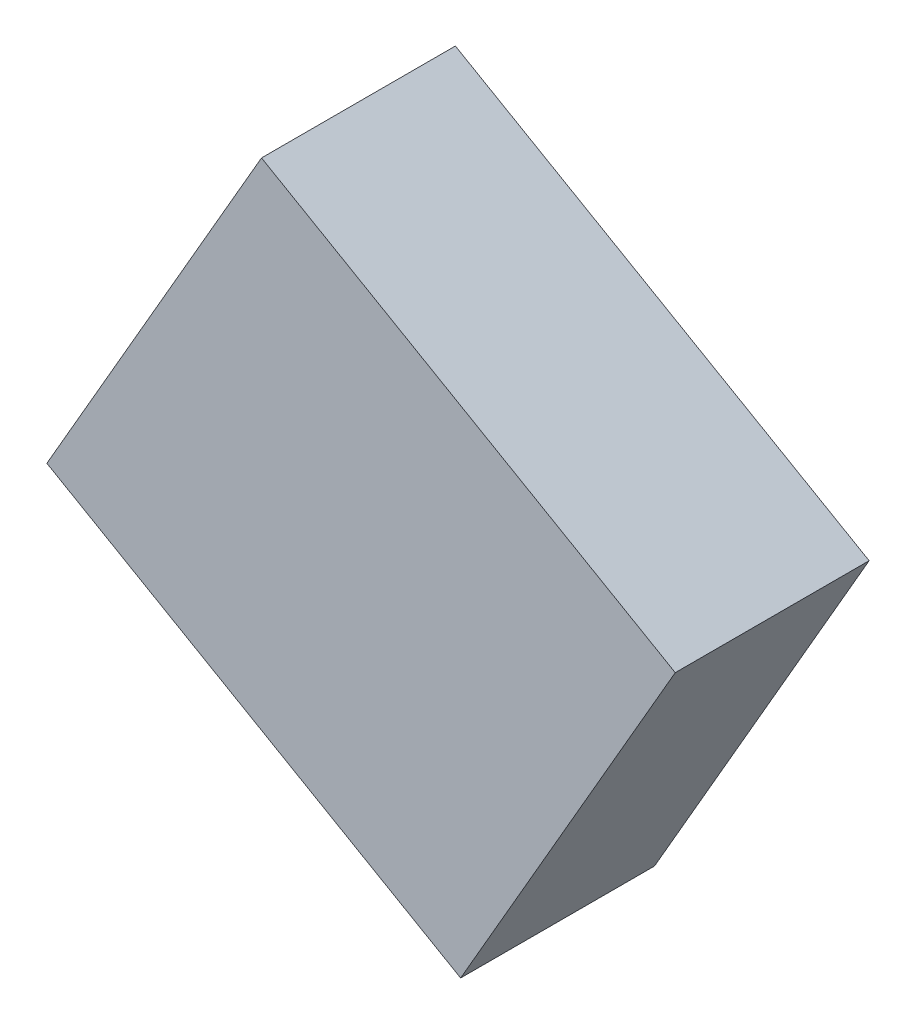
ISO-10303-21;
HEADER;
FILE_DESCRIPTION(('STEP AP214'),'2;1');
FILE_NAME('part.step','',(''),(''),'','','');
FILE_SCHEMA(('AUTOMOTIVE_DESIGN { 1 0 10303 214 1 1 1 1 }'));
ENDSEC;
DATA;
#1=APPLICATION_CONTEXT('core data for automotive mechanical design processes');
#2=APPLICATION_PROTOCOL_DEFINITION('international standard','automotive_design',2000,#1);
#3=PRODUCT_CONTEXT('',#1,'mechanical');
#4=PRODUCT('Part','Part','',(#3));
#5=PRODUCT_RELATED_PRODUCT_CATEGORY('part','',(#4));
#6=PRODUCT_DEFINITION_FORMATION('','',#4);
#7=PRODUCT_DEFINITION_CONTEXT('part definition',#1,'design');
#8=PRODUCT_DEFINITION('design','',#6,#7);
#9=PRODUCT_DEFINITION_SHAPE('','',#8);
#10=(LENGTH_UNIT() NAMED_UNIT(*) SI_UNIT(.MILLI.,.METRE.));
#11=(NAMED_UNIT(*) PLANE_ANGLE_UNIT() SI_UNIT($,.RADIAN.));
#12=(NAMED_UNIT(*) SI_UNIT($,.STERADIAN.) SOLID_ANGLE_UNIT());
#13=UNCERTAINTY_MEASURE_WITH_UNIT(LENGTH_MEASURE(1.E-05),#10,'distance_accuracy_value','');
#14=(GEOMETRIC_REPRESENTATION_CONTEXT(3) GLOBAL_UNCERTAINTY_ASSIGNED_CONTEXT((#13)) GLOBAL_UNIT_ASSIGNED_CONTEXT((#10,
#11,#12)) REPRESENTATION_CONTEXT('',''));
#15=CARTESIAN_POINT('',(0.,0.,0.));
#16=DIRECTION('',(0.,0.,1.));
#17=DIRECTION('',(1.,0.,0.));
#18=AXIS2_PLACEMENT_3D('',#15,#16,#17);
#19=CARTESIAN_POINT('',(-0.71889366,2.20483938,1.39999974));
#20=DIRECTION('',(0.,0.,-1.));
#21=DIRECTION('',(-1.,0.,0.));
#22=AXIS2_PLACEMENT_3D('',#19,#20,#21);
#23=PLANE('',#22);
#24=DIRECTION('',(-0.8660251598711,0.500000422470058,0.));
#25=VECTOR('',#24,1.);
#26=CARTESIAN_POINT('',(-2.2688931,-0.47983648,1.39999974));
#27=LINE('',#26,#25);
#28=CARTESIAN_POINT('',(-2.26889310000001,-0.479836479999993,1.39999974));
#29=VERTEX_POINT('',#28);
#30=CARTESIAN_POINT('',(0.718896199999887,-2.2048393800002,1.39999974));
#31=VERTEX_POINT('',#30);
#32=EDGE_CURVE('E54',#29,#31,#27,.F.);
#33=ORIENTED_EDGE('',*,*,#32,.T.);
#34=DIRECTION('',(-0.499999913646723,-0.866025453640521,0.));
#35=VECTOR('',#34,1.);
#36=CARTESIAN_POINT('',(0.7188962,-2.20483938,1.39999974));
#37=LINE('',#36,#35);
#38=CARTESIAN_POINT('',(2.26889564000015,0.479839019999916,1.39999974));
#39=VERTEX_POINT('',#38);
#40=EDGE_CURVE('E56',#31,#39,#37,.F.);
#41=ORIENTED_EDGE('',*,*,#40,.T.);
#42=DIRECTION('',(0.866025478669049,-0.499999870296028,0.));
#43=VECTOR('',#42,1.);
#44=CARTESIAN_POINT('',(2.26889564,0.47983902,1.39999974));
#45=LINE('',#44,#43);
#46=CARTESIAN_POINT('',(-0.718893660000355,2.20483937999939,1.39999974));
#47=VERTEX_POINT('',#46);
#48=EDGE_CURVE('E19',#39,#47,#45,.F.);
#49=ORIENTED_EDGE('',*,*,#48,.T.);
#50=DIRECTION('',(0.500000268437841,0.866025248801724,0.));
#51=VECTOR('',#50,1.);
#52=CARTESIAN_POINT('',(-0.71889366,2.20483938,1.39999974));
#53=LINE('',#52,#51);
#54=EDGE_CURVE('E79',#47,#29,#53,.F.);
#55=ORIENTED_EDGE('',*,*,#54,.T.);
#56=EDGE_LOOP('',(#33,#41,#49,#55));
#57=FACE_BOUND('',#56,.T.);
#58=ADVANCED_FACE('F16',(#57),#23,.F.);
#59=CARTESIAN_POINT('',(2.26889564,0.47983902,0.));
#60=DIRECTION('',(-0.499999870296028,-0.866025478669049,0.));
#61=DIRECTION('',(0.866025478669049,-0.499999870296028,0.));
#62=AXIS2_PLACEMENT_3D('',#59,#60,#61);
#63=PLANE('',#62);
#64=DIRECTION('',(0.,0.,1.));
#65=VECTOR('',#64,1.);
#66=CARTESIAN_POINT('',(-0.71889366,2.20483938,0.));
#67=LINE('',#66,#65);
#68=CARTESIAN_POINT('',(-0.718893660000355,2.20483937999939,0.));
#69=VERTEX_POINT('',#68);
#70=EDGE_CURVE('E67',#69,#47,#67,.T.);
#71=ORIENTED_EDGE('',*,*,#70,.T.);
#72=ORIENTED_EDGE('',*,*,#48,.F.);
#73=DIRECTION('',(0.,0.,1.));
#74=VECTOR('',#73,1.);
#75=CARTESIAN_POINT('',(2.26889564000058,0.479839019999665,0.));
#76=LINE('',#75,#74);
#77=CARTESIAN_POINT('',(2.26889564000015,0.479839019999916,0.));
#78=VERTEX_POINT('',#77);
#79=EDGE_CURVE('E62',#39,#78,#76,.F.);
#80=ORIENTED_EDGE('',*,*,#79,.T.);
#81=DIRECTION('',(0.866025478668843,-0.499999870296385,0.));
#82=VECTOR('',#81,1.);
#83=CARTESIAN_POINT('',(-0.71889366,2.20483938,0.));
#84=LINE('',#83,#82);
#85=EDGE_CURVE('E82',#69,#78,#84,.T.);
#86=ORIENTED_EDGE('',*,*,#85,.F.);
#87=EDGE_LOOP('',(#71,#72,#80,#86));
#88=FACE_BOUND('',#87,.T.);
#89=ADVANCED_FACE('F64',(#88),#63,.F.);
#90=CARTESIAN_POINT('',(0.7188962,-2.20483938,0.));
#91=DIRECTION('',(-0.866025453640521,0.499999913646723,0.));
#92=DIRECTION('',(-0.499999913646723,-0.866025453640521,0.));
#93=AXIS2_PLACEMENT_3D('',#90,#91,#92);
#94=PLANE('',#93);
#95=ORIENTED_EDGE('',*,*,#79,.F.);
#96=ORIENTED_EDGE('',*,*,#40,.F.);
#97=DIRECTION('',(0.,0.,1.));
#98=VECTOR('',#97,1.);
#99=CARTESIAN_POINT('',(0.718896199999547,-2.20483938000079,0.));
#100=LINE('',#99,#98);
#101=CARTESIAN_POINT('',(0.718896199999887,-2.2048393800002,0.));
#102=VERTEX_POINT('',#101);
#103=EDGE_CURVE('E74',#31,#102,#100,.F.);
#104=ORIENTED_EDGE('',*,*,#103,.T.);
#105=DIRECTION('',(-0.499999913646536,-0.866025453640629,0.));
#106=VECTOR('',#105,1.);
#107=CARTESIAN_POINT('',(2.26889564,0.47983902,0.));
#108=LINE('',#107,#106);
#109=EDGE_CURVE('E71',#78,#102,#108,.T.);
#110=ORIENTED_EDGE('',*,*,#109,.F.);
#111=EDGE_LOOP('',(#95,#96,#104,#110));
#112=FACE_BOUND('',#111,.T.);
#113=ADVANCED_FACE('F69',(#112),#94,.F.);
#114=CARTESIAN_POINT('',(-2.2688931,-0.47983648,0.));
#115=DIRECTION('',(0.500000422470058,0.8660251598711,0.));
#116=DIRECTION('',(-0.8660251598711,0.500000422470058,0.));
#117=AXIS2_PLACEMENT_3D('',#114,#115,#116);
#118=PLANE('',#117);
#119=ORIENTED_EDGE('',*,*,#103,.F.);
#120=ORIENTED_EDGE('',*,*,#32,.F.);
#121=DIRECTION('',(0.,0.,1.));
#122=VECTOR('',#121,1.);
#123=CARTESIAN_POINT('',(-2.26889310000005,-0.479836479999971,0.));
#124=LINE('',#123,#122);
#125=CARTESIAN_POINT('',(-2.26889310000001,-0.479836479999993,0.));
#126=VERTEX_POINT('',#125);
#127=EDGE_CURVE('E34',#29,#126,#124,.F.);
#128=ORIENTED_EDGE('',*,*,#127,.T.);
#129=DIRECTION('',(-0.866025159871231,0.50000042246983,0.));
#130=VECTOR('',#129,1.);
#131=CARTESIAN_POINT('',(0.7188962,-2.20483938,0.));
#132=LINE('',#131,#130);
#133=EDGE_CURVE('E25',#102,#126,#132,.T.);
#134=ORIENTED_EDGE('',*,*,#133,.F.);
#135=EDGE_LOOP('',(#119,#120,#128,#134));
#136=FACE_BOUND('',#135,.T.);
#137=ADVANCED_FACE('F88',(#136),#118,.F.);
#138=CARTESIAN_POINT('',(-0.71889366,2.20483938,0.));
#139=DIRECTION('',(0.866025248801724,-0.500000268437841,0.));
#140=DIRECTION('',(0.500000268437841,0.866025248801724,0.));
#141=AXIS2_PLACEMENT_3D('',#138,#139,#140);
#142=PLANE('',#141);
#143=ORIENTED_EDGE('',*,*,#127,.F.);
#144=ORIENTED_EDGE('',*,*,#54,.F.);
#145=ORIENTED_EDGE('',*,*,#70,.F.);
#146=DIRECTION('',(0.500000268437824,0.866025248801733,0.));
#147=VECTOR('',#146,1.);
#148=CARTESIAN_POINT('',(-2.2688931,-0.47983648,0.));
#149=LINE('',#148,#147);
#150=EDGE_CURVE('E11',#126,#69,#149,.T.);
#151=ORIENTED_EDGE('',*,*,#150,.F.);
#152=EDGE_LOOP('',(#143,#144,#145,#151));
#153=FACE_BOUND('',#152,.T.);
#154=ADVANCED_FACE('F90',(#153),#142,.F.);
#155=CARTESIAN_POINT('',(-0.71889366,2.20483938,0.));
#156=DIRECTION('',(0.,0.,-1.));
#157=DIRECTION('',(-1.,0.,0.));
#158=AXIS2_PLACEMENT_3D('',#155,#156,#157);
#159=PLANE('',#158);
#160=ORIENTED_EDGE('',*,*,#133,.T.);
#161=ORIENTED_EDGE('',*,*,#150,.T.);
#162=ORIENTED_EDGE('',*,*,#85,.T.);
#163=ORIENTED_EDGE('',*,*,#109,.T.);
#164=EDGE_LOOP('',(#160,#161,#162,#163));
#165=FACE_BOUND('',#164,.T.);
#166=ADVANCED_FACE('F87',(#165),#159,.T.);
#167=CLOSED_SHELL('',(#58,#89,#113,#137,#154,#166));
#168=MANIFOLD_SOLID_BREP('B1',#167);
#169=ADVANCED_BREP_SHAPE_REPRESENTATION('',(#18,#168),#14);
#170=SHAPE_DEFINITION_REPRESENTATION(#9,#169);
ENDSEC;
END-ISO-10303-21;
